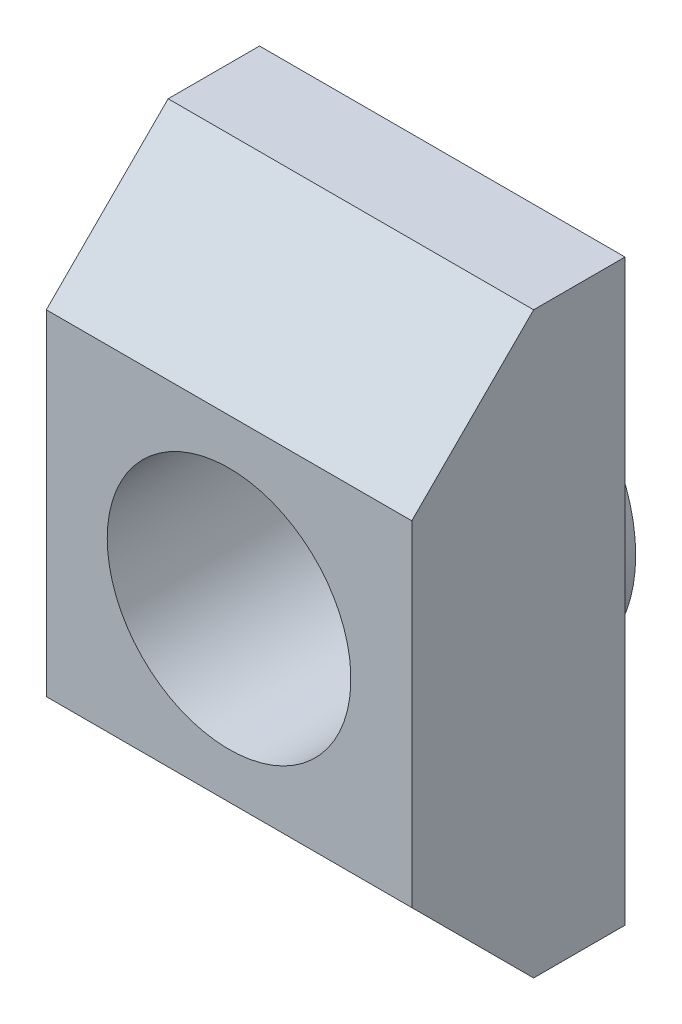
ISO-10303-21;
HEADER;
FILE_DESCRIPTION(('STEP AP214'),'2;1');
FILE_NAME('part.step','',(''),(''),'','','');
FILE_SCHEMA(('AUTOMOTIVE_DESIGN { 1 0 10303 214 1 1 1 1 }'));
ENDSEC;
DATA;
#1=APPLICATION_CONTEXT('core data for automotive mechanical design processes');
#2=APPLICATION_PROTOCOL_DEFINITION('international standard','automotive_design',2000,#1);
#3=PRODUCT_CONTEXT('',#1,'mechanical');
#4=PRODUCT('Part','Part','',(#3));
#5=PRODUCT_RELATED_PRODUCT_CATEGORY('part','',(#4));
#6=PRODUCT_DEFINITION_FORMATION('','',#4);
#7=PRODUCT_DEFINITION_CONTEXT('part definition',#1,'design');
#8=PRODUCT_DEFINITION('design','',#6,#7);
#9=PRODUCT_DEFINITION_SHAPE('','',#8);
#10=(LENGTH_UNIT() NAMED_UNIT(*) SI_UNIT(.MILLI.,.METRE.));
#11=(NAMED_UNIT(*) PLANE_ANGLE_UNIT() SI_UNIT($,.RADIAN.));
#12=(NAMED_UNIT(*) SI_UNIT($,.STERADIAN.) SOLID_ANGLE_UNIT());
#13=UNCERTAINTY_MEASURE_WITH_UNIT(LENGTH_MEASURE(1.E-05),#10,'distance_accuracy_value','');
#14=(GEOMETRIC_REPRESENTATION_CONTEXT(3) GLOBAL_UNCERTAINTY_ASSIGNED_CONTEXT((#13)) GLOBAL_UNIT_ASSIGNED_CONTEXT((#10,
#11,#12)) REPRESENTATION_CONTEXT('',''));
#15=CARTESIAN_POINT('',(0.,0.,0.));
#16=DIRECTION('',(0.,0.,1.));
#17=DIRECTION('',(1.,0.,0.));
#18=AXIS2_PLACEMENT_3D('',#15,#16,#17);
#19=CARTESIAN_POINT('',(0.,0.,2.92902435331399));
#20=DIRECTION('',(0.,0.,-1.));
#21=DIRECTION('',(-1.,0.,0.));
#22=AXIS2_PLACEMENT_3D('',#19,#20,#21);
#23=CYLINDRICAL_SURFACE('',#22,2.);
#24=CARTESIAN_POINT('',(0.,0.,-1.4372505879018));
#25=DIRECTION('',(0.,0.,-1.));
#26=DIRECTION('',(-1.,0.,0.));
#27=AXIS2_PLACEMENT_3D('',#24,#25,#26);
#28=CIRCLE('',#27,2.);
#29=CARTESIAN_POINT('',(-2.,0.,-1.4372505879018));
#30=VERTEX_POINT('',#29);
#31=EDGE_CURVE('E19',#30,#30,#28,.F.);
#32=ORIENTED_EDGE('',*,*,#31,.F.);
#33=EDGE_LOOP('',(#32));
#34=FACE_BOUND('',#33,.T.);
#35=CARTESIAN_POINT('',(0.,0.,2.6627494120982));
#36=DIRECTION('',(0.,0.,-1.));
#37=DIRECTION('',(-1.,0.,0.));
#38=AXIS2_PLACEMENT_3D('',#35,#36,#37);
#39=CIRCLE('',#38,2.);
#40=CARTESIAN_POINT('',(-2.,0.,2.6627494120982));
#41=VERTEX_POINT('',#40);
#42=EDGE_CURVE('E103',#41,#41,#39,.F.);
#43=ORIENTED_EDGE('',*,*,#42,.T.);
#44=EDGE_LOOP('',(#43));
#45=FACE_BOUND('',#44,.T.);
#46=ADVANCED_FACE('F16',(#34,#45),#23,.F.);
#47=CARTESIAN_POINT('',(0.,0.,-1.4372505879018));
#48=DIRECTION('',(0.,0.,-1.));
#49=DIRECTION('',(-1.,0.,0.));
#50=AXIS2_PLACEMENT_3D('',#47,#48,#49);
#51=PLANE('',#50);
#52=ORIENTED_EDGE('',*,*,#31,.T.);
#53=EDGE_LOOP('',(#52));
#54=FACE_BOUND('',#53,.T.);
#55=CARTESIAN_POINT('',(0.,0.,-1.4372505879018));
#56=DIRECTION('',(0.,0.,1.));
#57=DIRECTION('',(1.,0.,0.));
#58=AXIS2_PLACEMENT_3D('',#55,#56,#57);
#59=CIRCLE('',#58,2.57531937284929);
#60=CARTESIAN_POINT('',(2.57531937284929,0.,-1.4372505879018));
#61=VERTEX_POINT('',#60);
#62=EDGE_CURVE('E82',#61,#61,#59,.T.);
#63=ORIENTED_EDGE('',*,*,#62,.F.);
#64=EDGE_LOOP('',(#63));
#65=FACE_BOUND('',#64,.T.);
#66=ADVANCED_FACE('F115',(#54,#65),#51,.T.);
#67=CARTESIAN_POINT('',(3.,4.75,0.662749412098202));
#68=DIRECTION('',(0.,-0.707106781186548,-0.707106781186548));
#69=DIRECTION('',(0.,0.707106781186548,-0.707106781186548));
#70=AXIS2_PLACEMENT_3D('',#67,#68,#69);
#71=PLANE('',#70);
#72=DIRECTION('',(-1.,0.,0.));
#73=VECTOR('',#72,1.);
#74=CARTESIAN_POINT('',(3.,2.75,2.6627494120982));
#75=LINE('',#74,#73);
#76=CARTESIAN_POINT('',(-3.,2.75,2.6627494120982));
#77=VERTEX_POINT('',#76);
#78=CARTESIAN_POINT('',(3.,2.75,2.6627494120982));
#79=VERTEX_POINT('',#78);
#80=EDGE_CURVE('E101',#77,#79,#75,.F.);
#81=ORIENTED_EDGE('',*,*,#80,.T.);
#82=DIRECTION('',(0.,-0.707106781186548,0.707106781186547));
#83=VECTOR('',#82,1.);
#84=CARTESIAN_POINT('',(3.,4.75,0.662749412098202));
#85=LINE('',#84,#83);
#86=CARTESIAN_POINT('',(3.,4.75,0.662749412098202));
#87=VERTEX_POINT('',#86);
#88=EDGE_CURVE('E65',#87,#79,#85,.T.);
#89=ORIENTED_EDGE('',*,*,#88,.F.);
#90=DIRECTION('',(1.,0.,0.));
#91=VECTOR('',#90,1.);
#92=CARTESIAN_POINT('',(3.,4.75,0.662749412098202));
#93=LINE('',#92,#91);
#94=CARTESIAN_POINT('',(-3.,4.75,0.662749412098202));
#95=VERTEX_POINT('',#94);
#96=EDGE_CURVE('E166',#87,#95,#93,.F.);
#97=ORIENTED_EDGE('',*,*,#96,.T.);
#98=DIRECTION('',(0.,-0.707106781186548,0.707106781186547));
#99=VECTOR('',#98,1.);
#100=CARTESIAN_POINT('',(-3.,4.75,0.662749412098202));
#101=LINE('',#100,#99);
#102=EDGE_CURVE('E160',#95,#77,#101,.T.);
#103=ORIENTED_EDGE('',*,*,#102,.T.);
#104=EDGE_LOOP('',(#81,#89,#97,#103));
#105=FACE_BOUND('',#104,.T.);
#106=ADVANCED_FACE('F123',(#105),#71,.F.);
#107=CARTESIAN_POINT('',(3.,2.75,2.6627494120982));
#108=DIRECTION('',(0.,0.,-1.));
#109=DIRECTION('',(-1.,0.,0.));
#110=AXIS2_PLACEMENT_3D('',#107,#108,#109);
#111=PLANE('',#110);
#112=DIRECTION('',(1.,0.,0.));
#113=VECTOR('',#112,1.);
#114=CARTESIAN_POINT('',(3.,-2.75,2.6627494120982));
#115=LINE('',#114,#113);
#116=CARTESIAN_POINT('',(-3.,-2.75,2.6627494120982));
#117=VERTEX_POINT('',#116);
#118=CARTESIAN_POINT('',(3.,-2.75,2.6627494120982));
#119=VERTEX_POINT('',#118);
#120=EDGE_CURVE('E99',#117,#119,#115,.T.);
#121=ORIENTED_EDGE('',*,*,#120,.T.);
#122=DIRECTION('',(0.,1.,0.));
#123=VECTOR('',#122,1.);
#124=CARTESIAN_POINT('',(3.,0.,2.6627494120982));
#125=LINE('',#124,#123);
#126=EDGE_CURVE('E88',#79,#119,#125,.F.);
#127=ORIENTED_EDGE('',*,*,#126,.F.);
#128=ORIENTED_EDGE('',*,*,#80,.F.);
#129=DIRECTION('',(0.,1.,0.));
#130=VECTOR('',#129,1.);
#131=CARTESIAN_POINT('',(-3.,0.,2.6627494120982));
#132=LINE('',#131,#130);
#133=EDGE_CURVE('E170',#77,#117,#132,.F.);
#134=ORIENTED_EDGE('',*,*,#133,.T.);
#135=EDGE_LOOP('',(#121,#127,#128,#134));
#136=FACE_BOUND('',#135,.T.);
#137=ORIENTED_EDGE('',*,*,#42,.F.);
#138=EDGE_LOOP('',(#137));
#139=FACE_BOUND('',#138,.T.);
#140=ADVANCED_FACE('F150',(#136,#139),#111,.F.);
#141=CARTESIAN_POINT('',(3.,-2.75,2.6627494120982));
#142=DIRECTION('',(0.,0.707106781186548,-0.707106781186548));
#143=DIRECTION('',(0.,0.707106781186548,0.707106781186548));
#144=AXIS2_PLACEMENT_3D('',#141,#142,#143);
#145=PLANE('',#144);
#146=DIRECTION('',(1.,0.,0.));
#147=VECTOR('',#146,1.);
#148=CARTESIAN_POINT('',(3.,-4.75,0.662749412098202));
#149=LINE('',#148,#147);
#150=CARTESIAN_POINT('',(-3.,-4.75,0.662749412098201));
#151=VERTEX_POINT('',#150);
#152=CARTESIAN_POINT('',(3.,-4.75,0.662749412098202));
#153=VERTEX_POINT('',#152);
#154=EDGE_CURVE('E71',#151,#153,#149,.T.);
#155=ORIENTED_EDGE('',*,*,#154,.T.);
#156=DIRECTION('',(0.,-0.707106781186548,-0.707106781186547));
#157=VECTOR('',#156,1.);
#158=CARTESIAN_POINT('',(3.,-2.75,2.6627494120982));
#159=LINE('',#158,#157);
#160=EDGE_CURVE('E74',#119,#153,#159,.T.);
#161=ORIENTED_EDGE('',*,*,#160,.F.);
#162=ORIENTED_EDGE('',*,*,#120,.F.);
#163=DIRECTION('',(0.,-0.707106781186548,-0.707106781186547));
#164=VECTOR('',#163,1.);
#165=CARTESIAN_POINT('',(-3.,-2.75,2.6627494120982));
#166=LINE('',#165,#164);
#167=EDGE_CURVE('E76',#117,#151,#166,.T.);
#168=ORIENTED_EDGE('',*,*,#167,.T.);
#169=EDGE_LOOP('',(#155,#161,#162,#168));
#170=FACE_BOUND('',#169,.T.);
#171=ADVANCED_FACE('F73',(#170),#145,.F.);
#172=CARTESIAN_POINT('',(0.,0.,-1.4372505879018));
#173=DIRECTION('',(0.,0.,1.));
#174=DIRECTION('',(1.,0.,0.));
#175=AXIS2_PLACEMENT_3D('',#172,#173,#174);
#176=CYLINDRICAL_SURFACE('',#175,2.57531937284929);
#177=ORIENTED_EDGE('',*,*,#62,.T.);
#178=EDGE_LOOP('',(#177));
#179=FACE_BOUND('',#178,.T.);
#180=CARTESIAN_POINT('',(0.,0.,-0.837250587901798));
#181=DIRECTION('',(0.,0.,1.));
#182=DIRECTION('',(1.,0.,0.));
#183=AXIS2_PLACEMENT_3D('',#180,#181,#182);
#184=CIRCLE('',#183,2.57531937284929);
#185=CARTESIAN_POINT('',(2.57531937284929,0.,-0.837250587901798));
#186=VERTEX_POINT('',#185);
#187=EDGE_CURVE('E104',#186,#186,#184,.F.);
#188=ORIENTED_EDGE('',*,*,#187,.T.);
#189=EDGE_LOOP('',(#188));
#190=FACE_BOUND('',#189,.T.);
#191=ADVANCED_FACE('F144',(#179,#190),#176,.T.);
#192=CARTESIAN_POINT('',(3.,-4.75,0.662749412098202));
#193=DIRECTION('',(0.,1.,0.));
#194=DIRECTION('',(0.,0.,1.));
#195=AXIS2_PLACEMENT_3D('',#192,#193,#194);
#196=PLANE('',#195);
#197=DIRECTION('',(1.,0.,0.));
#198=VECTOR('',#197,1.);
#199=CARTESIAN_POINT('',(3.,-4.75,-0.837250587901798));
#200=LINE('',#199,#198);
#201=CARTESIAN_POINT('',(-3.,-4.75,-0.837250587901798));
#202=VERTEX_POINT('',#201);
#203=CARTESIAN_POINT('',(3.,-4.75,-0.837250587901798));
#204=VERTEX_POINT('',#203);
#205=EDGE_CURVE('E94',#202,#204,#200,.T.);
#206=ORIENTED_EDGE('',*,*,#205,.T.);
#207=DIRECTION('',(0.,0.,-1.));
#208=VECTOR('',#207,1.);
#209=CARTESIAN_POINT('',(3.,-4.75,0.));
#210=LINE('',#209,#208);
#211=EDGE_CURVE('E81',#153,#204,#210,.T.);
#212=ORIENTED_EDGE('',*,*,#211,.F.);
#213=ORIENTED_EDGE('',*,*,#154,.F.);
#214=DIRECTION('',(0.,0.,-1.));
#215=VECTOR('',#214,1.);
#216=CARTESIAN_POINT('',(-3.,-4.75,0.));
#217=LINE('',#216,#215);
#218=EDGE_CURVE('E107',#151,#202,#217,.T.);
#219=ORIENTED_EDGE('',*,*,#218,.T.);
#220=EDGE_LOOP('',(#206,#212,#213,#219));
#221=FACE_BOUND('',#220,.T.);
#222=ADVANCED_FACE('F93',(#221),#196,.F.);
#223=CARTESIAN_POINT('',(3.,0.,0.));
#224=DIRECTION('',(1.,0.,0.));
#225=DIRECTION('',(0.,0.,-1.));
#226=AXIS2_PLACEMENT_3D('',#223,#224,#225);
#227=PLANE('',#226);
#228=ORIENTED_EDGE('',*,*,#126,.T.);
#229=ORIENTED_EDGE('',*,*,#160,.T.);
#230=ORIENTED_EDGE('',*,*,#211,.T.);
#231=DIRECTION('',(0.,1.,0.));
#232=VECTOR('',#231,1.);
#233=CARTESIAN_POINT('',(3.,-4.75,-0.837250587901798));
#234=LINE('',#233,#232);
#235=CARTESIAN_POINT('',(3.,4.75,-0.837250587901798));
#236=VERTEX_POINT('',#235);
#237=EDGE_CURVE('E175',#204,#236,#234,.T.);
#238=ORIENTED_EDGE('',*,*,#237,.T.);
#239=DIRECTION('',(0.,0.,-1.));
#240=VECTOR('',#239,1.);
#241=CARTESIAN_POINT('',(3.,4.75,-0.837250587901798));
#242=LINE('',#241,#240);
#243=EDGE_CURVE('E90',#236,#87,#242,.F.);
#244=ORIENTED_EDGE('',*,*,#243,.T.);
#245=ORIENTED_EDGE('',*,*,#88,.T.);
#246=EDGE_LOOP('',(#228,#229,#230,#238,#244,#245));
#247=FACE_BOUND('',#246,.T.);
#248=ADVANCED_FACE('F84',(#247),#227,.T.);
#249=CARTESIAN_POINT('',(3.,4.75,-0.837250587901798));
#250=DIRECTION('',(0.,-1.,0.));
#251=DIRECTION('',(0.,0.,-1.));
#252=AXIS2_PLACEMENT_3D('',#249,#250,#251);
#253=PLANE('',#252);
#254=ORIENTED_EDGE('',*,*,#96,.F.);
#255=ORIENTED_EDGE('',*,*,#243,.F.);
#256=DIRECTION('',(1.,0.,0.));
#257=VECTOR('',#256,1.);
#258=CARTESIAN_POINT('',(3.,4.75,-0.837250587901798));
#259=LINE('',#258,#257);
#260=CARTESIAN_POINT('',(-3.,4.75,-0.837250587901798));
#261=VERTEX_POINT('',#260);
#262=EDGE_CURVE('E25',#236,#261,#259,.F.);
#263=ORIENTED_EDGE('',*,*,#262,.T.);
#264=DIRECTION('',(0.,0.,-1.));
#265=VECTOR('',#264,1.);
#266=CARTESIAN_POINT('',(-3.,4.75,0.));
#267=LINE('',#266,#265);
#268=EDGE_CURVE('E33',#261,#95,#267,.F.);
#269=ORIENTED_EDGE('',*,*,#268,.T.);
#270=EDGE_LOOP('',(#254,#255,#263,#269));
#271=FACE_BOUND('',#270,.T.);
#272=ADVANCED_FACE('F132',(#271),#253,.F.);
#273=CARTESIAN_POINT('',(-3.,0.,0.));
#274=DIRECTION('',(1.,0.,0.));
#275=DIRECTION('',(0.,0.,-1.));
#276=AXIS2_PLACEMENT_3D('',#273,#274,#275);
#277=PLANE('',#276);
#278=ORIENTED_EDGE('',*,*,#167,.F.);
#279=ORIENTED_EDGE('',*,*,#133,.F.);
#280=ORIENTED_EDGE('',*,*,#102,.F.);
#281=ORIENTED_EDGE('',*,*,#268,.F.);
#282=DIRECTION('',(0.,1.,0.));
#283=VECTOR('',#282,1.);
#284=CARTESIAN_POINT('',(-3.,-4.75,-0.837250587901798));
#285=LINE('',#284,#283);
#286=EDGE_CURVE('E11',#261,#202,#285,.F.);
#287=ORIENTED_EDGE('',*,*,#286,.T.);
#288=ORIENTED_EDGE('',*,*,#218,.F.);
#289=EDGE_LOOP('',(#278,#279,#280,#281,#287,#288));
#290=FACE_BOUND('',#289,.T.);
#291=ADVANCED_FACE('F126',(#290),#277,.F.);
#292=CARTESIAN_POINT('',(3.,-4.75,-0.837250587901798));
#293=DIRECTION('',(0.,0.,1.));
#294=DIRECTION('',(1.,0.,0.));
#295=AXIS2_PLACEMENT_3D('',#292,#293,#294);
#296=PLANE('',#295);
#297=ORIENTED_EDGE('',*,*,#262,.F.);
#298=ORIENTED_EDGE('',*,*,#237,.F.);
#299=ORIENTED_EDGE('',*,*,#205,.F.);
#300=ORIENTED_EDGE('',*,*,#286,.F.);
#301=EDGE_LOOP('',(#297,#298,#299,#300));
#302=FACE_BOUND('',#301,.T.);
#303=ORIENTED_EDGE('',*,*,#187,.F.);
#304=EDGE_LOOP('',(#303));
#305=FACE_BOUND('',#304,.T.);
#306=ADVANCED_FACE('F124',(#302,#305),#296,.F.);
#307=CLOSED_SHELL('',(#46,#66,#106,#140,#171,#191,#222,#248,#272,#291,#306));
#308=MANIFOLD_SOLID_BREP('B1',#307);
#309=ADVANCED_BREP_SHAPE_REPRESENTATION('',(#18,#308),#14);
#310=SHAPE_DEFINITION_REPRESENTATION(#9,#309);
ENDSEC;
END-ISO-10303-21;
